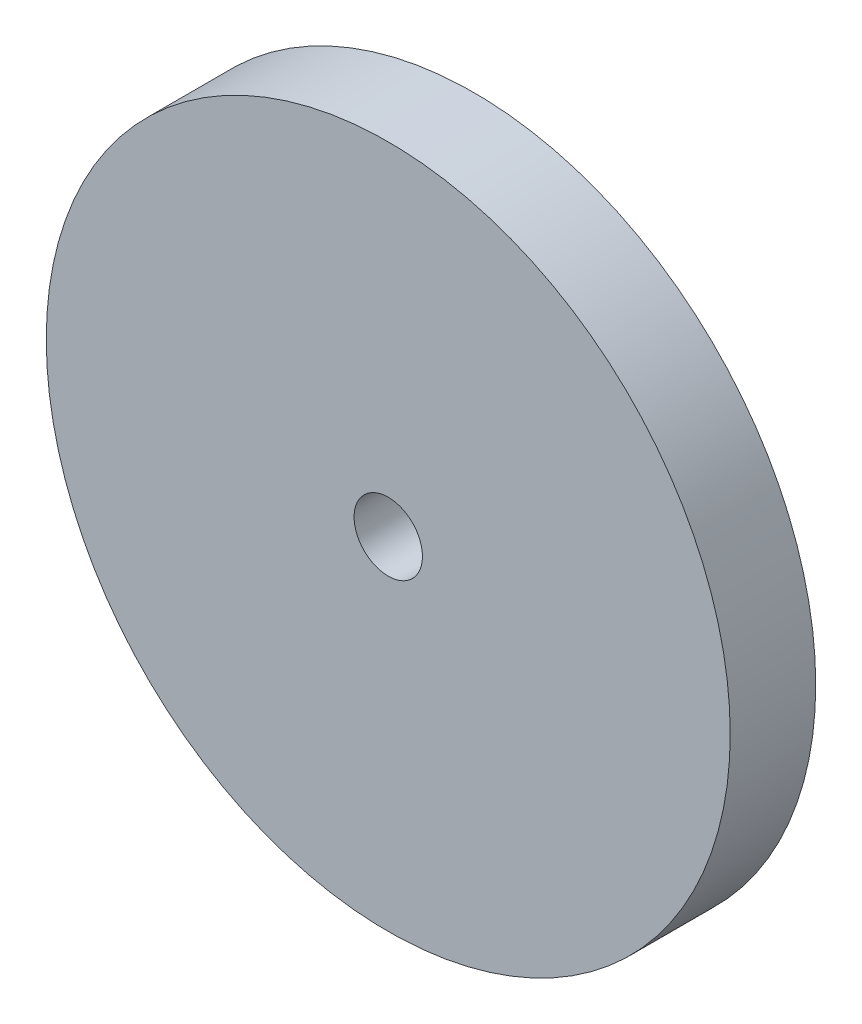
ISO-10303-21;
HEADER;
FILE_DESCRIPTION(('STEP AP214'),'2;1');
FILE_NAME('part.step','',(''),(''),'','','');
FILE_SCHEMA(('AUTOMOTIVE_DESIGN { 1 0 10303 214 1 1 1 1 }'));
ENDSEC;
DATA;
#1=APPLICATION_CONTEXT('core data for automotive mechanical design processes');
#2=APPLICATION_PROTOCOL_DEFINITION('international standard','automotive_design',2000,#1);
#3=PRODUCT_CONTEXT('',#1,'mechanical');
#4=PRODUCT('Part','Part','',(#3));
#5=PRODUCT_RELATED_PRODUCT_CATEGORY('part','',(#4));
#6=PRODUCT_DEFINITION_FORMATION('','',#4);
#7=PRODUCT_DEFINITION_CONTEXT('part definition',#1,'design');
#8=PRODUCT_DEFINITION('design','',#6,#7);
#9=PRODUCT_DEFINITION_SHAPE('','',#8);
#10=(LENGTH_UNIT() NAMED_UNIT(*) SI_UNIT(.MILLI.,.METRE.));
#11=(NAMED_UNIT(*) PLANE_ANGLE_UNIT() SI_UNIT($,.RADIAN.));
#12=(NAMED_UNIT(*) SI_UNIT($,.STERADIAN.) SOLID_ANGLE_UNIT());
#13=UNCERTAINTY_MEASURE_WITH_UNIT(LENGTH_MEASURE(1.E-05),#10,'distance_accuracy_value','');
#14=(GEOMETRIC_REPRESENTATION_CONTEXT(3) GLOBAL_UNCERTAINTY_ASSIGNED_CONTEXT((#13)) GLOBAL_UNIT_ASSIGNED_CONTEXT((#10,
#11,#12)) REPRESENTATION_CONTEXT('',''));
#15=CARTESIAN_POINT('',(0.,0.,0.));
#16=DIRECTION('',(0.,0.,1.));
#17=DIRECTION('',(1.,0.,0.));
#18=AXIS2_PLACEMENT_3D('',#15,#16,#17);
#19=CARTESIAN_POINT('',(0.,0.,3.175));
#20=DIRECTION('',(0.,0.,1.));
#21=DIRECTION('',(1.,0.,0.));
#22=AXIS2_PLACEMENT_3D('',#19,#20,#21);
#23=PLANE('',#22);
#24=CARTESIAN_POINT('',(0.,0.,3.175));
#25=DIRECTION('',(0.,0.,1.));
#26=DIRECTION('',(1.,0.,0.));
#27=AXIS2_PLACEMENT_3D('',#24,#25,#26);
#28=CIRCLE('',#27,12.7);
#29=CARTESIAN_POINT('',(12.7,0.,3.175));
#30=VERTEX_POINT('',#29);
#31=EDGE_CURVE('E10',#30,#30,#28,.T.);
#32=ORIENTED_EDGE('',*,*,#31,.T.);
#33=EDGE_LOOP('',(#32));
#34=FACE_BOUND('',#33,.T.);
#35=CARTESIAN_POINT('',(0.,0.,3.175));
#36=DIRECTION('',(0.,0.,1.));
#37=DIRECTION('',(1.,0.,0.));
#38=AXIS2_PLACEMENT_3D('',#35,#36,#37);
#39=CIRCLE('',#38,1.27);
#40=CARTESIAN_POINT('',(1.27,0.,3.175));
#41=VERTEX_POINT('',#40);
#42=EDGE_CURVE('E48',#41,#41,#39,.T.);
#43=ORIENTED_EDGE('',*,*,#42,.F.);
#44=EDGE_LOOP('',(#43));
#45=FACE_BOUND('',#44,.T.);
#46=ADVANCED_FACE('F37',(#34,#45),#23,.T.);
#47=CARTESIAN_POINT('',(0.,0.,0.));
#48=DIRECTION('',(0.,0.,1.));
#49=DIRECTION('',(1.,0.,0.));
#50=AXIS2_PLACEMENT_3D('',#47,#48,#49);
#51=PLANE('',#50);
#52=CARTESIAN_POINT('',(0.,0.,0.));
#53=DIRECTION('',(0.,0.,1.));
#54=DIRECTION('',(1.,0.,0.));
#55=AXIS2_PLACEMENT_3D('',#52,#53,#54);
#56=CIRCLE('',#55,12.7);
#57=CARTESIAN_POINT('',(12.7,0.,0.));
#58=VERTEX_POINT('',#57);
#59=EDGE_CURVE('E41',#58,#58,#56,.T.);
#60=ORIENTED_EDGE('',*,*,#59,.F.);
#61=EDGE_LOOP('',(#60));
#62=FACE_BOUND('',#61,.T.);
#63=CARTESIAN_POINT('',(0.,0.,0.));
#64=DIRECTION('',(0.,0.,1.));
#65=DIRECTION('',(1.,0.,0.));
#66=AXIS2_PLACEMENT_3D('',#63,#64,#65);
#67=CIRCLE('',#66,1.27);
#68=CARTESIAN_POINT('',(1.27,0.,0.));
#69=VERTEX_POINT('',#68);
#70=EDGE_CURVE('E50',#69,#69,#67,.T.);
#71=ORIENTED_EDGE('',*,*,#70,.T.);
#72=EDGE_LOOP('',(#71));
#73=FACE_BOUND('',#72,.T.);
#74=ADVANCED_FACE('F60',(#62,#73),#51,.F.);
#75=CARTESIAN_POINT('',(0.,0.,3.175));
#76=DIRECTION('',(0.,0.,-1.));
#77=DIRECTION('',(-1.,0.,0.));
#78=AXIS2_PLACEMENT_3D('',#75,#76,#77);
#79=CYLINDRICAL_SURFACE('',#78,12.7);
#80=ORIENTED_EDGE('',*,*,#31,.F.);
#81=EDGE_LOOP('',(#80));
#82=FACE_BOUND('',#81,.T.);
#83=ORIENTED_EDGE('',*,*,#59,.T.);
#84=EDGE_LOOP('',(#83));
#85=FACE_BOUND('',#84,.T.);
#86=ADVANCED_FACE('F39',(#82,#85),#79,.T.);
#87=CARTESIAN_POINT('',(0.,0.,3.175));
#88=DIRECTION('',(0.,0.,-1.));
#89=DIRECTION('',(-1.,0.,0.));
#90=AXIS2_PLACEMENT_3D('',#87,#88,#89);
#91=CYLINDRICAL_SURFACE('',#90,1.27);
#92=ORIENTED_EDGE('',*,*,#42,.T.);
#93=EDGE_LOOP('',(#92));
#94=FACE_BOUND('',#93,.T.);
#95=ORIENTED_EDGE('',*,*,#70,.F.);
#96=EDGE_LOOP('',(#95));
#97=FACE_BOUND('',#96,.T.);
#98=ADVANCED_FACE('F56',(#94,#97),#91,.F.);
#99=CLOSED_SHELL('',(#46,#74,#86,#98));
#100=MANIFOLD_SOLID_BREP('B2',#99);
#101=ADVANCED_BREP_SHAPE_REPRESENTATION('',(#18,#100),#14);
#102=SHAPE_DEFINITION_REPRESENTATION(#9,#101);
ENDSEC;
END-ISO-10303-21;
